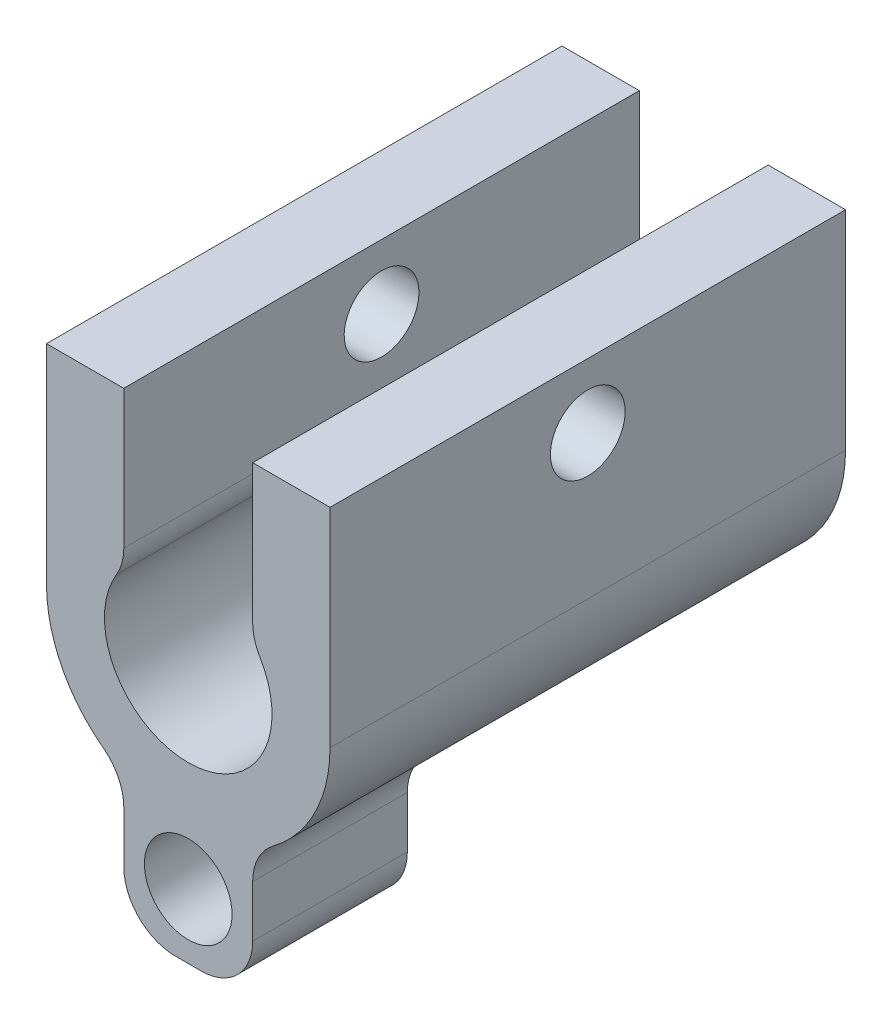
ISO-10303-21;
HEADER;
FILE_DESCRIPTION(('STEP AP214'),'2;1');
FILE_NAME('part.step','',(''),(''),'','','');
FILE_SCHEMA(('AUTOMOTIVE_DESIGN { 1 0 10303 214 1 1 1 1 }'));
ENDSEC;
DATA;
#1=APPLICATION_CONTEXT('core data for automotive mechanical design processes');
#2=APPLICATION_PROTOCOL_DEFINITION('international standard','automotive_design',2000,#1);
#3=PRODUCT_CONTEXT('',#1,'mechanical');
#4=PRODUCT('Part','Part','',(#3));
#5=PRODUCT_RELATED_PRODUCT_CATEGORY('part','',(#4));
#6=PRODUCT_DEFINITION_FORMATION('','',#4);
#7=PRODUCT_DEFINITION_CONTEXT('part definition',#1,'design');
#8=PRODUCT_DEFINITION('design','',#6,#7);
#9=PRODUCT_DEFINITION_SHAPE('','',#8);
#10=(LENGTH_UNIT() NAMED_UNIT(*) SI_UNIT(.MILLI.,.METRE.));
#11=(NAMED_UNIT(*) PLANE_ANGLE_UNIT() SI_UNIT($,.RADIAN.));
#12=(NAMED_UNIT(*) SI_UNIT($,.STERADIAN.) SOLID_ANGLE_UNIT());
#13=UNCERTAINTY_MEASURE_WITH_UNIT(LENGTH_MEASURE(1.E-05),#10,'distance_accuracy_value','');
#14=(GEOMETRIC_REPRESENTATION_CONTEXT(3) GLOBAL_UNCERTAINTY_ASSIGNED_CONTEXT((#13)) GLOBAL_UNIT_ASSIGNED_CONTEXT((#10,
#11,#12)) REPRESENTATION_CONTEXT('',''));
#15=CARTESIAN_POINT('',(0.,0.,0.));
#16=DIRECTION('',(0.,0.,1.));
#17=DIRECTION('',(1.,0.,0.));
#18=AXIS2_PLACEMENT_3D('',#15,#16,#17);
#19=CARTESIAN_POINT('',(0.,0.,20.));
#20=DIRECTION('',(0.,0.,-1.));
#21=DIRECTION('',(-1.,0.,0.));
#22=AXIS2_PLACEMENT_3D('',#19,#20,#21);
#23=CYLINDRICAL_SURFACE('',#22,5.5);
#24=CARTESIAN_POINT('',(0.,0.,0.));
#25=DIRECTION('',(0.,0.,1.));
#26=DIRECTION('',(1.,0.,0.));
#27=AXIS2_PLACEMENT_3D('',#24,#25,#26);
#28=CIRCLE('',#27,5.5);
#29=CARTESIAN_POINT('',(-5.5,0.,0.));
#30=VERTEX_POINT('',#29);
#31=CARTESIAN_POINT('',(-3.3,-4.4,0.));
#32=VERTEX_POINT('',#31);
#33=EDGE_CURVE('E370',#30,#32,#28,.T.);
#34=ORIENTED_EDGE('',*,*,#33,.T.);
#35=DIRECTION('',(0.,0.,-1.));
#36=VECTOR('',#35,1.);
#37=CARTESIAN_POINT('',(-3.3,-4.4,28.655634003353));
#38=LINE('',#37,#36);
#39=CARTESIAN_POINT('',(-3.3,-4.4,14.));
#40=VERTEX_POINT('',#39);
#41=EDGE_CURVE('E349',#40,#32,#38,.T.);
#42=ORIENTED_EDGE('',*,*,#41,.F.);
#43=DIRECTION('',(0.,0.,-1.));
#44=VECTOR('',#43,1.);
#45=CARTESIAN_POINT('',(-3.3,-4.4,20.));
#46=LINE('',#45,#44);
#47=CARTESIAN_POINT('',(-3.3,-4.4,20.));
#48=VERTEX_POINT('',#47);
#49=EDGE_CURVE('E226',#48,#40,#46,.T.);
#50=ORIENTED_EDGE('',*,*,#49,.F.);
#51=CARTESIAN_POINT('',(0.,0.,20.));
#52=DIRECTION('',(0.,0.,1.));
#53=DIRECTION('',(1.,0.,0.));
#54=AXIS2_PLACEMENT_3D('',#51,#52,#53);
#55=CIRCLE('',#54,5.5);
#56=CARTESIAN_POINT('',(-5.5,0.,20.));
#57=VERTEX_POINT('',#56);
#58=EDGE_CURVE('E298',#57,#48,#55,.T.);
#59=ORIENTED_EDGE('',*,*,#58,.F.);
#60=DIRECTION('',(0.,0.,-1.));
#61=VECTOR('',#60,1.);
#62=CARTESIAN_POINT('',(-5.5,0.,20.));
#63=LINE('',#62,#61);
#64=EDGE_CURVE('E299',#57,#30,#63,.T.);
#65=ORIENTED_EDGE('',*,*,#64,.T.);
#66=EDGE_LOOP('',(#34,#42,#50,#59,#65));
#67=FACE_BOUND('',#66,.T.);
#68=ADVANCED_FACE('F41',(#67),#23,.T.);
#69=CARTESIAN_POINT('',(-4.5,-6.,20.));
#70=DIRECTION('',(0.,0.,-1.));
#71=DIRECTION('',(-1.,0.,0.));
#72=AXIS2_PLACEMENT_3D('',#69,#70,#71);
#73=CYLINDRICAL_SURFACE('',#72,2.);
#74=ORIENTED_EDGE('',*,*,#49,.T.);
#75=CARTESIAN_POINT('',(-4.5,-6.,14.));
#76=DIRECTION('',(0.,0.,1.));
#77=DIRECTION('',(1.,0.,0.));
#78=AXIS2_PLACEMENT_3D('',#75,#76,#77);
#79=CIRCLE('',#78,2.);
#80=CARTESIAN_POINT('',(-2.5,-6.,14.));
#81=VERTEX_POINT('',#80);
#82=EDGE_CURVE('E350',#81,#40,#79,.T.);
#83=ORIENTED_EDGE('',*,*,#82,.F.);
#84=DIRECTION('',(0.,0.,-1.));
#85=VECTOR('',#84,1.);
#86=CARTESIAN_POINT('',(-2.5,-6.,20.));
#87=LINE('',#86,#85);
#88=CARTESIAN_POINT('',(-2.5,-6.,20.));
#89=VERTEX_POINT('',#88);
#90=EDGE_CURVE('E222',#89,#81,#87,.T.);
#91=ORIENTED_EDGE('',*,*,#90,.F.);
#92=CARTESIAN_POINT('',(-4.5,-6.,20.));
#93=DIRECTION('',(0.,0.,-1.));
#94=DIRECTION('',(-1.,0.,0.));
#95=AXIS2_PLACEMENT_3D('',#92,#93,#94);
#96=CIRCLE('',#95,2.);
#97=EDGE_CURVE('E374',#48,#89,#96,.T.);
#98=ORIENTED_EDGE('',*,*,#97,.F.);
#99=EDGE_LOOP('',(#74,#83,#91,#98));
#100=FACE_BOUND('',#99,.T.);
#101=ADVANCED_FACE('F455',(#100),#73,.F.);
#102=CARTESIAN_POINT('',(-2.5,-6.,20.));
#103=DIRECTION('',(1.,0.,0.));
#104=DIRECTION('',(0.,0.,-1.));
#105=AXIS2_PLACEMENT_3D('',#102,#103,#104);
#106=PLANE('',#105);
#107=ORIENTED_EDGE('',*,*,#90,.T.);
#108=DIRECTION('',(0.,1.,0.));
#109=VECTOR('',#108,1.);
#110=CARTESIAN_POINT('',(-2.5,-8.,14.));
#111=LINE('',#110,#109);
#112=CARTESIAN_POINT('',(-2.5,-8.,14.));
#113=VERTEX_POINT('',#112);
#114=EDGE_CURVE('E354',#113,#81,#111,.T.);
#115=ORIENTED_EDGE('',*,*,#114,.F.);
#116=DIRECTION('',(0.,0.,-1.));
#117=VECTOR('',#116,1.);
#118=CARTESIAN_POINT('',(-2.5,-8.,20.));
#119=LINE('',#118,#117);
#120=CARTESIAN_POINT('',(-2.5,-8.,20.));
#121=VERTEX_POINT('',#120);
#122=EDGE_CURVE('E218',#121,#113,#119,.T.);
#123=ORIENTED_EDGE('',*,*,#122,.F.);
#124=DIRECTION('',(0.,-1.,0.));
#125=VECTOR('',#124,1.);
#126=CARTESIAN_POINT('',(-2.5,-6.,20.));
#127=LINE('',#126,#125);
#128=EDGE_CURVE('E377',#89,#121,#127,.T.);
#129=ORIENTED_EDGE('',*,*,#128,.F.);
#130=EDGE_LOOP('',(#107,#115,#123,#129));
#131=FACE_BOUND('',#130,.T.);
#132=ADVANCED_FACE('F460',(#131),#106,.F.);
#133=CARTESIAN_POINT('',(-0.5,-8.,20.));
#134=DIRECTION('',(0.,0.,-1.));
#135=DIRECTION('',(-1.,0.,0.));
#136=AXIS2_PLACEMENT_3D('',#133,#134,#135);
#137=CYLINDRICAL_SURFACE('',#136,2.);
#138=ORIENTED_EDGE('',*,*,#122,.T.);
#139=CARTESIAN_POINT('',(-0.5,-8.,14.));
#140=DIRECTION('',(0.,0.,1.));
#141=DIRECTION('',(1.,0.,0.));
#142=AXIS2_PLACEMENT_3D('',#139,#140,#141);
#143=CIRCLE('',#142,2.);
#144=CARTESIAN_POINT('',(-0.5,-10.,14.));
#145=VERTEX_POINT('',#144);
#146=EDGE_CURVE('E357',#145,#113,#143,.F.);
#147=ORIENTED_EDGE('',*,*,#146,.F.);
#148=DIRECTION('',(0.,0.,-1.));
#149=VECTOR('',#148,1.);
#150=CARTESIAN_POINT('',(-0.5,-10.,20.));
#151=LINE('',#150,#149);
#152=CARTESIAN_POINT('',(-0.5,-10.,20.));
#153=VERTEX_POINT('',#152);
#154=EDGE_CURVE('E209',#153,#145,#151,.T.);
#155=ORIENTED_EDGE('',*,*,#154,.F.);
#156=CARTESIAN_POINT('',(-0.5,-8.,20.));
#157=DIRECTION('',(0.,0.,1.));
#158=DIRECTION('',(-1.,0.,0.));
#159=AXIS2_PLACEMENT_3D('',#156,#157,#158);
#160=CIRCLE('',#159,2.);
#161=EDGE_CURVE('E380',#121,#153,#160,.T.);
#162=ORIENTED_EDGE('',*,*,#161,.F.);
#163=EDGE_LOOP('',(#138,#147,#155,#162));
#164=FACE_BOUND('',#163,.T.);
#165=ADVANCED_FACE('F466',(#164),#137,.T.);
#166=CARTESIAN_POINT('',(-0.5,-10.,20.));
#167=DIRECTION('',(0.,1.,0.));
#168=DIRECTION('',(0.,0.,1.));
#169=AXIS2_PLACEMENT_3D('',#166,#167,#168);
#170=PLANE('',#169);
#171=ORIENTED_EDGE('',*,*,#154,.T.);
#172=DIRECTION('',(-1.,0.,0.));
#173=VECTOR('',#172,1.);
#174=CARTESIAN_POINT('',(0.5,-10.,14.));
#175=LINE('',#174,#173);
#176=CARTESIAN_POINT('',(0.500000000000001,-10.,14.));
#177=VERTEX_POINT('',#176);
#178=EDGE_CURVE('E200',#177,#145,#175,.T.);
#179=ORIENTED_EDGE('',*,*,#178,.F.);
#180=DIRECTION('',(0.,0.,-1.));
#181=VECTOR('',#180,1.);
#182=CARTESIAN_POINT('',(0.5,-10.,20.));
#183=LINE('',#182,#181);
#184=CARTESIAN_POINT('',(0.5,-10.,20.));
#185=VERTEX_POINT('',#184);
#186=EDGE_CURVE('E198',#185,#177,#183,.T.);
#187=ORIENTED_EDGE('',*,*,#186,.F.);
#188=DIRECTION('',(1.,0.,0.));
#189=VECTOR('',#188,1.);
#190=CARTESIAN_POINT('',(-0.5,-10.,20.));
#191=LINE('',#190,#189);
#192=EDGE_CURVE('E383',#153,#185,#191,.T.);
#193=ORIENTED_EDGE('',*,*,#192,.F.);
#194=EDGE_LOOP('',(#171,#179,#187,#193));
#195=FACE_BOUND('',#194,.T.);
#196=ADVANCED_FACE('F470',(#195),#170,.F.);
#197=CARTESIAN_POINT('',(0.5,-8.,20.));
#198=DIRECTION('',(0.,0.,-1.));
#199=DIRECTION('',(-1.,0.,0.));
#200=AXIS2_PLACEMENT_3D('',#197,#198,#199);
#201=CYLINDRICAL_SURFACE('',#200,2.);
#202=ORIENTED_EDGE('',*,*,#186,.T.);
#203=CARTESIAN_POINT('',(0.500000000000015,-8.00000000000002,14.));
#204=DIRECTION('',(0.,0.,1.));
#205=DIRECTION('',(1.,0.,0.));
#206=AXIS2_PLACEMENT_3D('',#203,#204,#205);
#207=CIRCLE('',#206,1.99999999999999);
#208=CARTESIAN_POINT('',(2.5,-8.00000000000001,14.));
#209=VERTEX_POINT('',#208);
#210=EDGE_CURVE('E178',#209,#177,#207,.F.);
#211=ORIENTED_EDGE('',*,*,#210,.F.);
#212=DIRECTION('',(0.,0.,-1.));
#213=VECTOR('',#212,1.);
#214=CARTESIAN_POINT('',(2.5,-8.,20.));
#215=LINE('',#214,#213);
#216=CARTESIAN_POINT('',(2.5,-8.,20.));
#217=VERTEX_POINT('',#216);
#218=EDGE_CURVE('E195',#217,#209,#215,.T.);
#219=ORIENTED_EDGE('',*,*,#218,.F.);
#220=CARTESIAN_POINT('',(0.5,-8.,20.));
#221=DIRECTION('',(0.,0.,1.));
#222=DIRECTION('',(1.,0.,0.));
#223=AXIS2_PLACEMENT_3D('',#220,#221,#222);
#224=CIRCLE('',#223,2.);
#225=EDGE_CURVE('E386',#185,#217,#224,.T.);
#226=ORIENTED_EDGE('',*,*,#225,.F.);
#227=EDGE_LOOP('',(#202,#211,#219,#226));
#228=FACE_BOUND('',#227,.T.);
#229=ADVANCED_FACE('F193',(#228),#201,.T.);
#230=CARTESIAN_POINT('',(2.5,-8.,20.));
#231=DIRECTION('',(-1.,0.,0.));
#232=DIRECTION('',(0.,0.,1.));
#233=AXIS2_PLACEMENT_3D('',#230,#231,#232);
#234=PLANE('',#233);
#235=ORIENTED_EDGE('',*,*,#218,.T.);
#236=DIRECTION('',(0.,-1.,0.));
#237=VECTOR('',#236,1.);
#238=CARTESIAN_POINT('',(2.5,-6.,14.));
#239=LINE('',#238,#237);
#240=CARTESIAN_POINT('',(2.5,-6.,14.));
#241=VERTEX_POINT('',#240);
#242=EDGE_CURVE('E175',#241,#209,#239,.T.);
#243=ORIENTED_EDGE('',*,*,#242,.F.);
#244=DIRECTION('',(0.,0.,-1.));
#245=VECTOR('',#244,1.);
#246=CARTESIAN_POINT('',(2.5,-6.,20.));
#247=LINE('',#246,#245);
#248=CARTESIAN_POINT('',(2.5,-6.,20.));
#249=VERTEX_POINT('',#248);
#250=EDGE_CURVE('E205',#249,#241,#247,.T.);
#251=ORIENTED_EDGE('',*,*,#250,.F.);
#252=DIRECTION('',(0.,1.,0.));
#253=VECTOR('',#252,1.);
#254=CARTESIAN_POINT('',(2.5,-8.,20.));
#255=LINE('',#254,#253);
#256=EDGE_CURVE('E203',#217,#249,#255,.T.);
#257=ORIENTED_EDGE('',*,*,#256,.F.);
#258=EDGE_LOOP('',(#235,#243,#251,#257));
#259=FACE_BOUND('',#258,.T.);
#260=ADVANCED_FACE('F202',(#259),#234,.F.);
#261=CARTESIAN_POINT('',(4.5,-6.,20.));
#262=DIRECTION('',(0.,0.,-1.));
#263=DIRECTION('',(-1.,0.,0.));
#264=AXIS2_PLACEMENT_3D('',#261,#262,#263);
#265=CYLINDRICAL_SURFACE('',#264,2.);
#266=ORIENTED_EDGE('',*,*,#250,.T.);
#267=CARTESIAN_POINT('',(4.5,-6.,14.));
#268=DIRECTION('',(0.,0.,1.));
#269=DIRECTION('',(1.,0.,0.));
#270=AXIS2_PLACEMENT_3D('',#267,#268,#269);
#271=CIRCLE('',#270,2.);
#272=CARTESIAN_POINT('',(3.3,-4.4,14.));
#273=VERTEX_POINT('',#272);
#274=EDGE_CURVE('E182',#273,#241,#271,.T.);
#275=ORIENTED_EDGE('',*,*,#274,.F.);
#276=DIRECTION('',(0.,0.,-1.));
#277=VECTOR('',#276,1.);
#278=CARTESIAN_POINT('',(3.3,-4.4,20.));
#279=LINE('',#278,#277);
#280=CARTESIAN_POINT('',(3.3,-4.4,20.));
#281=VERTEX_POINT('',#280);
#282=EDGE_CURVE('E211',#281,#273,#279,.T.);
#283=ORIENTED_EDGE('',*,*,#282,.F.);
#284=CARTESIAN_POINT('',(4.5,-6.,20.));
#285=DIRECTION('',(0.,0.,-1.));
#286=DIRECTION('',(1.,0.,0.));
#287=AXIS2_PLACEMENT_3D('',#284,#285,#286);
#288=CIRCLE('',#287,2.);
#289=EDGE_CURVE('E335',#249,#281,#288,.T.);
#290=ORIENTED_EDGE('',*,*,#289,.F.);
#291=EDGE_LOOP('',(#266,#275,#283,#290));
#292=FACE_BOUND('',#291,.T.);
#293=ADVANCED_FACE('F334',(#292),#265,.F.);
#294=CARTESIAN_POINT('',(0.,0.,20.));
#295=DIRECTION('',(0.,0.,-1.));
#296=DIRECTION('',(-1.,0.,0.));
#297=AXIS2_PLACEMENT_3D('',#294,#295,#296);
#298=CYLINDRICAL_SURFACE('',#297,5.5);
#299=CARTESIAN_POINT('',(0.,0.,0.));
#300=DIRECTION('',(0.,0.,1.));
#301=DIRECTION('',(1.,0.,0.));
#302=AXIS2_PLACEMENT_3D('',#299,#300,#301);
#303=CIRCLE('',#302,5.5);
#304=CARTESIAN_POINT('',(3.3,-4.4,0.));
#305=VERTEX_POINT('',#304);
#306=CARTESIAN_POINT('',(5.5,0.,0.));
#307=VERTEX_POINT('',#306);
#308=EDGE_CURVE('E413',#305,#307,#303,.T.);
#309=ORIENTED_EDGE('',*,*,#308,.T.);
#310=DIRECTION('',(0.,0.,-1.));
#311=VECTOR('',#310,1.);
#312=CARTESIAN_POINT('',(5.5,0.,20.));
#313=LINE('',#312,#311);
#314=CARTESIAN_POINT('',(5.5,0.,20.));
#315=VERTEX_POINT('',#314);
#316=EDGE_CURVE('E318',#315,#307,#313,.T.);
#317=ORIENTED_EDGE('',*,*,#316,.F.);
#318=CARTESIAN_POINT('',(0.,0.,20.));
#319=DIRECTION('',(0.,0.,1.));
#320=DIRECTION('',(1.,0.,0.));
#321=AXIS2_PLACEMENT_3D('',#318,#319,#320);
#322=CIRCLE('',#321,5.5);
#323=EDGE_CURVE('E331',#281,#315,#322,.T.);
#324=ORIENTED_EDGE('',*,*,#323,.F.);
#325=ORIENTED_EDGE('',*,*,#282,.T.);
#326=DIRECTION('',(0.,0.,-1.));
#327=VECTOR('',#326,1.);
#328=CARTESIAN_POINT('',(3.3,-4.4,28.655634003353));
#329=LINE('',#328,#327);
#330=EDGE_CURVE('E328',#273,#305,#329,.T.);
#331=ORIENTED_EDGE('',*,*,#330,.T.);
#332=EDGE_LOOP('',(#309,#317,#324,#325,#331));
#333=FACE_BOUND('',#332,.T.);
#334=ADVANCED_FACE('F327',(#333),#298,.T.);
#335=CARTESIAN_POINT('',(5.5,0.,20.));
#336=DIRECTION('',(-1.,0.,0.));
#337=DIRECTION('',(0.,0.,1.));
#338=AXIS2_PLACEMENT_3D('',#335,#336,#337);
#339=PLANE('',#338);
#340=CARTESIAN_POINT('',(5.5,5.57665596572952,10.));
#341=DIRECTION('',(1.,0.,0.));
#342=DIRECTION('',(0.,0.,-1.));
#343=AXIS2_PLACEMENT_3D('',#340,#341,#342);
#344=CIRCLE('',#343,1.45);
#345=CARTESIAN_POINT('',(5.5,5.57665596572952,8.55));
#346=VERTEX_POINT('',#345);
#347=EDGE_CURVE('E337',#346,#346,#344,.T.);
#348=ORIENTED_EDGE('',*,*,#347,.F.);
#349=EDGE_LOOP('',(#348));
#350=FACE_BOUND('',#349,.T.);
#351=DIRECTION('',(0.,1.,0.));
#352=VECTOR('',#351,1.);
#353=CARTESIAN_POINT('',(5.5,0.,0.));
#354=LINE('',#353,#352);
#355=CARTESIAN_POINT('',(5.5,8.07665596572952,0.));
#356=VERTEX_POINT('',#355);
#357=EDGE_CURVE('E286',#307,#356,#354,.T.);
#358=ORIENTED_EDGE('',*,*,#357,.T.);
#359=DIRECTION('',(0.,0.,-1.));
#360=VECTOR('',#359,1.);
#361=CARTESIAN_POINT('',(5.5,8.07665596572952,20.));
#362=LINE('',#361,#360);
#363=CARTESIAN_POINT('',(5.5,8.07665596572952,20.));
#364=VERTEX_POINT('',#363);
#365=EDGE_CURVE('E314',#364,#356,#362,.T.);
#366=ORIENTED_EDGE('',*,*,#365,.F.);
#367=DIRECTION('',(0.,1.,0.));
#368=VECTOR('',#367,1.);
#369=CARTESIAN_POINT('',(5.5,0.,20.));
#370=LINE('',#369,#368);
#371=EDGE_CURVE('E395',#315,#364,#370,.T.);
#372=ORIENTED_EDGE('',*,*,#371,.F.);
#373=ORIENTED_EDGE('',*,*,#316,.T.);
#374=EDGE_LOOP('',(#358,#366,#372,#373));
#375=FACE_BOUND('',#374,.T.);
#376=ADVANCED_FACE('F419',(#350,#375),#339,.F.);
#377=CARTESIAN_POINT('',(5.5,8.07665596572952,20.));
#378=DIRECTION('',(0.,-1.,0.));
#379=DIRECTION('',(0.,0.,-1.));
#380=AXIS2_PLACEMENT_3D('',#377,#378,#379);
#381=PLANE('',#380);
#382=DIRECTION('',(-1.,0.,0.));
#383=VECTOR('',#382,1.);
#384=CARTESIAN_POINT('',(5.5,8.07665596572952,0.));
#385=LINE('',#384,#383);
#386=CARTESIAN_POINT('',(2.5,8.07665596572952,0.));
#387=VERTEX_POINT('',#386);
#388=EDGE_CURVE('E280',#356,#387,#385,.T.);
#389=ORIENTED_EDGE('',*,*,#388,.T.);
#390=DIRECTION('',(0.,0.,-1.));
#391=VECTOR('',#390,1.);
#392=CARTESIAN_POINT('',(2.5,8.07665596572952,20.));
#393=LINE('',#392,#391);
#394=CARTESIAN_POINT('',(2.5,8.07665596572952,20.));
#395=VERTEX_POINT('',#394);
#396=EDGE_CURVE('E278',#395,#387,#393,.T.);
#397=ORIENTED_EDGE('',*,*,#396,.F.);
#398=DIRECTION('',(-1.,0.,0.));
#399=VECTOR('',#398,1.);
#400=CARTESIAN_POINT('',(5.5,8.07665596572952,20.));
#401=LINE('',#400,#399);
#402=EDGE_CURVE('E398',#364,#395,#401,.T.);
#403=ORIENTED_EDGE('',*,*,#402,.F.);
#404=ORIENTED_EDGE('',*,*,#365,.T.);
#405=EDGE_LOOP('',(#389,#397,#403,#404));
#406=FACE_BOUND('',#405,.T.);
#407=ADVANCED_FACE('F423',(#406),#381,.F.);
#408=CARTESIAN_POINT('',(2.5,8.07665596572952,20.));
#409=DIRECTION('',(1.,0.,0.));
#410=DIRECTION('',(0.,1.,0.));
#411=AXIS2_PLACEMENT_3D('',#408,#409,#410);
#412=PLANE('',#411);
#413=CARTESIAN_POINT('',(2.5,5.57665596572952,10.));
#414=DIRECTION('',(1.,0.,0.));
#415=DIRECTION('',(0.,1.,0.));
#416=AXIS2_PLACEMENT_3D('',#413,#414,#415);
#417=CIRCLE('',#416,1.45);
#418=CARTESIAN_POINT('',(2.5,7.02665596572952,10.));
#419=VERTEX_POINT('',#418);
#420=EDGE_CURVE('E235',#419,#419,#417,.T.);
#421=ORIENTED_EDGE('',*,*,#420,.T.);
#422=EDGE_LOOP('',(#421));
#423=FACE_BOUND('',#422,.T.);
#424=DIRECTION('',(0.,-1.,0.));
#425=VECTOR('',#424,1.);
#426=CARTESIAN_POINT('',(2.5,8.07665596572952,0.));
#427=LINE('',#426,#425);
#428=CARTESIAN_POINT('',(2.5,2.70416345659799,0.));
#429=VERTEX_POINT('',#428);
#430=EDGE_CURVE('E273',#387,#429,#427,.T.);
#431=ORIENTED_EDGE('',*,*,#430,.T.);
#432=DIRECTION('',(0.,0.,-1.));
#433=VECTOR('',#432,1.);
#434=CARTESIAN_POINT('',(2.5,2.70416345659799,20.));
#435=LINE('',#434,#433);
#436=CARTESIAN_POINT('',(2.5,2.70416345659799,20.));
#437=VERTEX_POINT('',#436);
#438=EDGE_CURVE('E65',#429,#437,#435,.F.);
#439=ORIENTED_EDGE('',*,*,#438,.T.);
#440=DIRECTION('',(0.,-1.,0.));
#441=VECTOR('',#440,1.);
#442=CARTESIAN_POINT('',(2.5,8.07665596572952,20.));
#443=LINE('',#442,#441);
#444=EDGE_CURVE('E257',#395,#437,#443,.T.);
#445=ORIENTED_EDGE('',*,*,#444,.F.);
#446=ORIENTED_EDGE('',*,*,#396,.T.);
#447=EDGE_LOOP('',(#431,#439,#445,#446));
#448=FACE_BOUND('',#447,.T.);
#449=ADVANCED_FACE('F276',(#423,#448),#412,.F.);
#450=CARTESIAN_POINT('',(0.,0.,20.));
#451=DIRECTION('',(0.,0.,-1.));
#452=DIRECTION('',(-1.,0.,0.));
#453=AXIS2_PLACEMENT_3D('',#450,#451,#452);
#454=CYLINDRICAL_SURFACE('',#453,3.25);
#455=CARTESIAN_POINT('',(0.,0.,20.));
#456=DIRECTION('',(0.,0.,-1.));
#457=DIRECTION('',(1.,0.,0.));
#458=AXIS2_PLACEMENT_3D('',#455,#456,#457);
#459=CIRCLE('',#458,3.25);
#460=CARTESIAN_POINT('',(2.78571428571429,1.67400594932257,20.));
#461=VERTEX_POINT('',#460);
#462=CARTESIAN_POINT('',(-2.78571428571429,1.67400594932257,20.));
#463=VERTEX_POINT('',#462);
#464=EDGE_CURVE('E256',#461,#463,#459,.T.);
#465=ORIENTED_EDGE('',*,*,#464,.F.);
#466=DIRECTION('',(0.,0.,-1.));
#467=VECTOR('',#466,1.);
#468=CARTESIAN_POINT('',(2.78571428571429,1.67400594932257,20.));
#469=LINE('',#468,#467);
#470=CARTESIAN_POINT('',(2.78571428571429,1.67400594932257,0.));
#471=VERTEX_POINT('',#470);
#472=EDGE_CURVE('E239',#461,#471,#469,.T.);
#473=ORIENTED_EDGE('',*,*,#472,.T.);
#474=CARTESIAN_POINT('',(0.,0.,0.));
#475=DIRECTION('',(0.,0.,-1.));
#476=DIRECTION('',(1.,0.,0.));
#477=AXIS2_PLACEMENT_3D('',#474,#475,#476);
#478=CIRCLE('',#477,3.25);
#479=CARTESIAN_POINT('',(-2.78571428571429,1.67400594932257,0.));
#480=VERTEX_POINT('',#479);
#481=EDGE_CURVE('E274',#471,#480,#478,.T.);
#482=ORIENTED_EDGE('',*,*,#481,.T.);
#483=DIRECTION('',(0.,0.,-1.));
#484=VECTOR('',#483,1.);
#485=CARTESIAN_POINT('',(-2.78571428571429,1.67400594932257,20.));
#486=LINE('',#485,#484);
#487=EDGE_CURVE('E230',#480,#463,#486,.F.);
#488=ORIENTED_EDGE('',*,*,#487,.T.);
#489=EDGE_LOOP('',(#465,#473,#482,#488));
#490=FACE_BOUND('',#489,.T.);
#491=ADVANCED_FACE('F261',(#490),#454,.F.);
#492=CARTESIAN_POINT('',(-2.5,8.07665596572952,20.));
#493=DIRECTION('',(-1.,0.,0.));
#494=DIRECTION('',(0.,-1.,0.));
#495=AXIS2_PLACEMENT_3D('',#492,#493,#494);
#496=PLANE('',#495);
#497=CARTESIAN_POINT('',(-2.5,5.57665596572952,10.));
#498=DIRECTION('',(-1.,0.,0.));
#499=DIRECTION('',(0.,-1.,0.));
#500=AXIS2_PLACEMENT_3D('',#497,#498,#499);
#501=CIRCLE('',#500,1.45);
#502=CARTESIAN_POINT('',(-2.5,4.12665596572952,10.));
#503=VERTEX_POINT('',#502);
#504=EDGE_CURVE('E231',#503,#503,#501,.T.);
#505=ORIENTED_EDGE('',*,*,#504,.T.);
#506=EDGE_LOOP('',(#505));
#507=FACE_BOUND('',#506,.T.);
#508=DIRECTION('',(0.,1.,0.));
#509=VECTOR('',#508,1.);
#510=CARTESIAN_POINT('',(-2.5,8.07665596572952,20.));
#511=LINE('',#510,#509);
#512=CARTESIAN_POINT('',(-2.5,2.70416345659799,20.));
#513=VERTEX_POINT('',#512);
#514=CARTESIAN_POINT('',(-2.5,8.07665596572952,20.));
#515=VERTEX_POINT('',#514);
#516=EDGE_CURVE('E266',#513,#515,#511,.T.);
#517=ORIENTED_EDGE('',*,*,#516,.F.);
#518=DIRECTION('',(0.,0.,-1.));
#519=VECTOR('',#518,1.);
#520=CARTESIAN_POINT('',(-2.5,2.70416345659799,20.));
#521=LINE('',#520,#519);
#522=CARTESIAN_POINT('',(-2.5,2.70416345659799,0.));
#523=VERTEX_POINT('',#522);
#524=EDGE_CURVE('E12',#513,#523,#521,.T.);
#525=ORIENTED_EDGE('',*,*,#524,.T.);
#526=DIRECTION('',(0.,1.,0.));
#527=VECTOR('',#526,1.);
#528=CARTESIAN_POINT('',(-2.5,8.07665596572952,0.));
#529=LINE('',#528,#527);
#530=CARTESIAN_POINT('',(-2.5,8.07665596572952,0.));
#531=VERTEX_POINT('',#530);
#532=EDGE_CURVE('E284',#523,#531,#529,.T.);
#533=ORIENTED_EDGE('',*,*,#532,.T.);
#534=DIRECTION('',(0.,0.,-1.));
#535=VECTOR('',#534,1.);
#536=CARTESIAN_POINT('',(-2.5,8.07665596572952,20.));
#537=LINE('',#536,#535);
#538=EDGE_CURVE('E308',#515,#531,#537,.T.);
#539=ORIENTED_EDGE('',*,*,#538,.F.);
#540=EDGE_LOOP('',(#517,#525,#533,#539));
#541=FACE_BOUND('',#540,.T.);
#542=ADVANCED_FACE('F446',(#507,#541),#496,.F.);
#543=CARTESIAN_POINT('',(-5.5,8.07665596572952,20.));
#544=DIRECTION('',(0.,-1.,0.));
#545=DIRECTION('',(0.,0.,-1.));
#546=AXIS2_PLACEMENT_3D('',#543,#544,#545);
#547=PLANE('',#546);
#548=DIRECTION('',(-1.,0.,0.));
#549=VECTOR('',#548,1.);
#550=CARTESIAN_POINT('',(-5.5,8.07665596572952,0.));
#551=LINE('',#550,#549);
#552=CARTESIAN_POINT('',(-5.5,8.07665596572952,0.));
#553=VERTEX_POINT('',#552);
#554=EDGE_CURVE('E292',#531,#553,#551,.T.);
#555=ORIENTED_EDGE('',*,*,#554,.T.);
#556=DIRECTION('',(0.,0.,-1.));
#557=VECTOR('',#556,1.);
#558=CARTESIAN_POINT('',(-5.5,8.07665596572952,20.));
#559=LINE('',#558,#557);
#560=CARTESIAN_POINT('',(-5.5,8.07665596572952,20.));
#561=VERTEX_POINT('',#560);
#562=EDGE_CURVE('E303',#561,#553,#559,.T.);
#563=ORIENTED_EDGE('',*,*,#562,.F.);
#564=DIRECTION('',(-1.,0.,0.));
#565=VECTOR('',#564,1.);
#566=CARTESIAN_POINT('',(-5.5,8.07665596572952,20.));
#567=LINE('',#566,#565);
#568=EDGE_CURVE('E405',#515,#561,#567,.T.);
#569=ORIENTED_EDGE('',*,*,#568,.F.);
#570=ORIENTED_EDGE('',*,*,#538,.T.);
#571=EDGE_LOOP('',(#555,#563,#569,#570));
#572=FACE_BOUND('',#571,.T.);
#573=ADVANCED_FACE('F442',(#572),#547,.F.);
#574=CARTESIAN_POINT('',(-5.5,0.,20.));
#575=DIRECTION('',(1.,0.,0.));
#576=DIRECTION('',(0.,0.,-1.));
#577=AXIS2_PLACEMENT_3D('',#574,#575,#576);
#578=PLANE('',#577);
#579=CARTESIAN_POINT('',(-5.5,5.57665596572952,10.));
#580=DIRECTION('',(1.,0.,0.));
#581=DIRECTION('',(0.,0.,-1.));
#582=AXIS2_PLACEMENT_3D('',#579,#580,#581);
#583=CIRCLE('',#582,1.45);
#584=CARTESIAN_POINT('',(-5.5,5.57665596572952,8.55));
#585=VERTEX_POINT('',#584);
#586=EDGE_CURVE('E236',#585,#585,#583,.T.);
#587=ORIENTED_EDGE('',*,*,#586,.T.);
#588=EDGE_LOOP('',(#587));
#589=FACE_BOUND('',#588,.T.);
#590=DIRECTION('',(0.,-1.,0.));
#591=VECTOR('',#590,1.);
#592=CARTESIAN_POINT('',(-5.5,0.,0.));
#593=LINE('',#592,#591);
#594=EDGE_CURVE('E295',#553,#30,#593,.T.);
#595=ORIENTED_EDGE('',*,*,#594,.T.);
#596=ORIENTED_EDGE('',*,*,#64,.F.);
#597=DIRECTION('',(0.,-1.,0.));
#598=VECTOR('',#597,1.);
#599=CARTESIAN_POINT('',(-5.5,0.,20.));
#600=LINE('',#599,#598);
#601=EDGE_CURVE('E304',#561,#57,#600,.T.);
#602=ORIENTED_EDGE('',*,*,#601,.F.);
#603=ORIENTED_EDGE('',*,*,#562,.T.);
#604=EDGE_LOOP('',(#595,#596,#602,#603));
#605=FACE_BOUND('',#604,.T.);
#606=ADVANCED_FACE('F437',(#589,#605),#578,.F.);
#607=CARTESIAN_POINT('',(0.,0.,20.));
#608=DIRECTION('',(0.,0.,1.));
#609=DIRECTION('',(1.,0.,0.));
#610=AXIS2_PLACEMENT_3D('',#607,#608,#609);
#611=PLANE('',#610);
#612=CARTESIAN_POINT('',(0.,-7.5,20.));
#613=DIRECTION('',(0.,0.,1.));
#614=DIRECTION('',(1.,0.,0.));
#615=AXIS2_PLACEMENT_3D('',#612,#613,#614);
#616=CIRCLE('',#615,1.7);
#617=CARTESIAN_POINT('',(1.7,-7.5,20.));
#618=VERTEX_POINT('',#617);
#619=EDGE_CURVE('E524',#618,#618,#616,.T.);
#620=ORIENTED_EDGE('',*,*,#619,.F.);
#621=EDGE_LOOP('',(#620));
#622=FACE_BOUND('',#621,.T.);
#623=ORIENTED_EDGE('',*,*,#444,.T.);
#624=CARTESIAN_POINT('',(4.5,2.70416345659799,20.));
#625=DIRECTION('',(0.,0.,1.));
#626=DIRECTION('',(1.,0.,0.));
#627=AXIS2_PLACEMENT_3D('',#624,#625,#626);
#628=CIRCLE('',#627,2.);
#629=EDGE_CURVE('E50',#437,#461,#628,.T.);
#630=ORIENTED_EDGE('',*,*,#629,.T.);
#631=ORIENTED_EDGE('',*,*,#464,.T.);
#632=CARTESIAN_POINT('',(-4.5,2.70416345659799,20.));
#633=DIRECTION('',(0.,0.,1.));
#634=DIRECTION('',(1.,0.,0.));
#635=AXIS2_PLACEMENT_3D('',#632,#633,#634);
#636=CIRCLE('',#635,2.);
#637=EDGE_CURVE('E57',#463,#513,#636,.T.);
#638=ORIENTED_EDGE('',*,*,#637,.T.);
#639=ORIENTED_EDGE('',*,*,#516,.T.);
#640=ORIENTED_EDGE('',*,*,#568,.T.);
#641=ORIENTED_EDGE('',*,*,#601,.T.);
#642=ORIENTED_EDGE('',*,*,#58,.T.);
#643=ORIENTED_EDGE('',*,*,#97,.T.);
#644=ORIENTED_EDGE('',*,*,#128,.T.);
#645=ORIENTED_EDGE('',*,*,#161,.T.);
#646=ORIENTED_EDGE('',*,*,#192,.T.);
#647=ORIENTED_EDGE('',*,*,#225,.T.);
#648=ORIENTED_EDGE('',*,*,#256,.T.);
#649=ORIENTED_EDGE('',*,*,#289,.T.);
#650=ORIENTED_EDGE('',*,*,#323,.T.);
#651=ORIENTED_EDGE('',*,*,#371,.T.);
#652=ORIENTED_EDGE('',*,*,#402,.T.);
#653=EDGE_LOOP('',(#623,#630,#631,#638,#639,#640,#641,#642,#643,#644,#645,#646,#647,#648,#649,
#650,#651,#652));
#654=FACE_BOUND('',#653,.T.);
#655=ADVANCED_FACE('F255',(#622,#654),#611,.T.);
#656=CARTESIAN_POINT('',(0.,0.,0.));
#657=DIRECTION('',(0.,0.,1.));
#658=DIRECTION('',(1.,0.,0.));
#659=AXIS2_PLACEMENT_3D('',#656,#657,#658);
#660=PLANE('',#659);
#661=ORIENTED_EDGE('',*,*,#481,.F.);
#662=CARTESIAN_POINT('',(4.5,2.70416345659799,0.));
#663=DIRECTION('',(0.,0.,1.));
#664=DIRECTION('',(1.,0.,0.));
#665=AXIS2_PLACEMENT_3D('',#662,#663,#664);
#666=CIRCLE('',#665,2.);
#667=EDGE_CURVE('E246',#471,#429,#666,.F.);
#668=ORIENTED_EDGE('',*,*,#667,.T.);
#669=ORIENTED_EDGE('',*,*,#430,.F.);
#670=ORIENTED_EDGE('',*,*,#388,.F.);
#671=ORIENTED_EDGE('',*,*,#357,.F.);
#672=ORIENTED_EDGE('',*,*,#308,.F.);
#673=DIRECTION('',(1.,0.,0.));
#674=VECTOR('',#673,1.);
#675=CARTESIAN_POINT('',(3.3,-4.4,0.));
#676=LINE('',#675,#674);
#677=EDGE_CURVE('E188',#32,#305,#676,.T.);
#678=ORIENTED_EDGE('',*,*,#677,.F.);
#679=ORIENTED_EDGE('',*,*,#33,.F.);
#680=ORIENTED_EDGE('',*,*,#594,.F.);
#681=ORIENTED_EDGE('',*,*,#554,.F.);
#682=ORIENTED_EDGE('',*,*,#532,.F.);
#683=CARTESIAN_POINT('',(-4.5,2.70416345659799,0.));
#684=DIRECTION('',(0.,0.,1.));
#685=DIRECTION('',(1.,0.,0.));
#686=AXIS2_PLACEMENT_3D('',#683,#684,#685);
#687=CIRCLE('',#686,2.);
#688=EDGE_CURVE('E243',#523,#480,#687,.F.);
#689=ORIENTED_EDGE('',*,*,#688,.T.);
#690=EDGE_LOOP('',(#661,#668,#669,#670,#671,#672,#678,#679,#680,#681,#682,#689));
#691=FACE_BOUND('',#690,.T.);
#692=ADVANCED_FACE('F271',(#691),#660,.F.);
#693=CARTESIAN_POINT('',(5.5,5.57665596572952,10.));
#694=DIRECTION('',(1.,0.,0.));
#695=DIRECTION('',(0.,0.,-1.));
#696=AXIS2_PLACEMENT_3D('',#693,#694,#695);
#697=CYLINDRICAL_SURFACE('',#696,1.45);
#698=ORIENTED_EDGE('',*,*,#586,.F.);
#699=EDGE_LOOP('',(#698));
#700=FACE_BOUND('',#699,.T.);
#701=ORIENTED_EDGE('',*,*,#504,.F.);
#702=EDGE_LOOP('',(#701));
#703=FACE_BOUND('',#702,.T.);
#704=ADVANCED_FACE('F503',(#700,#703),#697,.F.);
#705=ORIENTED_EDGE('',*,*,#347,.T.);
#706=EDGE_LOOP('',(#705));
#707=FACE_BOUND('',#706,.T.);
#708=ORIENTED_EDGE('',*,*,#420,.F.);
#709=EDGE_LOOP('',(#708));
#710=FACE_BOUND('',#709,.T.);
#711=ADVANCED_FACE('F507',(#707,#710),#697,.F.);
#712=CARTESIAN_POINT('',(0.,0.,14.));
#713=DIRECTION('',(0.,0.,1.));
#714=DIRECTION('',(1.,0.,0.));
#715=AXIS2_PLACEMENT_3D('',#712,#713,#714);
#716=PLANE('',#715);
#717=CARTESIAN_POINT('',(0.,-7.5,14.));
#718=DIRECTION('',(0.,0.,1.));
#719=DIRECTION('',(1.,0.,0.));
#720=AXIS2_PLACEMENT_3D('',#717,#718,#719);
#721=CIRCLE('',#720,1.7);
#722=CARTESIAN_POINT('',(1.7,-7.5,14.));
#723=VERTEX_POINT('',#722);
#724=EDGE_CURVE('E429',#723,#723,#721,.T.);
#725=ORIENTED_EDGE('',*,*,#724,.T.);
#726=EDGE_LOOP('',(#725));
#727=FACE_BOUND('',#726,.T.);
#728=ORIENTED_EDGE('',*,*,#274,.T.);
#729=ORIENTED_EDGE('',*,*,#242,.T.);
#730=ORIENTED_EDGE('',*,*,#210,.T.);
#731=ORIENTED_EDGE('',*,*,#178,.T.);
#732=ORIENTED_EDGE('',*,*,#146,.T.);
#733=ORIENTED_EDGE('',*,*,#114,.T.);
#734=ORIENTED_EDGE('',*,*,#82,.T.);
#735=DIRECTION('',(1.,0.,0.));
#736=VECTOR('',#735,1.);
#737=CARTESIAN_POINT('',(3.3,-4.4,14.));
#738=LINE('',#737,#736);
#739=EDGE_CURVE('E343',#40,#273,#738,.T.);
#740=ORIENTED_EDGE('',*,*,#739,.T.);
#741=EDGE_LOOP('',(#728,#729,#730,#731,#732,#733,#734,#740));
#742=FACE_BOUND('',#741,.T.);
#743=ADVANCED_FACE('F177',(#727,#742),#716,.F.);
#744=CARTESIAN_POINT('',(3.3,-4.4,28.655634003353));
#745=DIRECTION('',(0.,1.,0.));
#746=DIRECTION('',(-1.,0.,0.));
#747=AXIS2_PLACEMENT_3D('',#744,#745,#746);
#748=PLANE('',#747);
#749=ORIENTED_EDGE('',*,*,#41,.T.);
#750=ORIENTED_EDGE('',*,*,#677,.T.);
#751=ORIENTED_EDGE('',*,*,#330,.F.);
#752=ORIENTED_EDGE('',*,*,#739,.F.);
#753=EDGE_LOOP('',(#749,#750,#751,#752));
#754=FACE_BOUND('',#753,.T.);
#755=ADVANCED_FACE('F513',(#754),#748,.F.);
#756=CARTESIAN_POINT('',(0.,-7.5,20.));
#757=DIRECTION('',(0.,0.,1.));
#758=DIRECTION('',(1.,0.,0.));
#759=AXIS2_PLACEMENT_3D('',#756,#757,#758);
#760=CYLINDRICAL_SURFACE('',#759,1.7);
#761=ORIENTED_EDGE('',*,*,#619,.T.);
#762=EDGE_LOOP('',(#761));
#763=FACE_BOUND('',#762,.T.);
#764=ORIENTED_EDGE('',*,*,#724,.F.);
#765=EDGE_LOOP('',(#764));
#766=FACE_BOUND('',#765,.T.);
#767=ADVANCED_FACE('F453',(#763,#766),#760,.F.);
#768=CARTESIAN_POINT('',(4.5,2.70416345659799,20.));
#769=DIRECTION('',(0.,0.,-1.));
#770=DIRECTION('',(-1.,0.,0.));
#771=AXIS2_PLACEMENT_3D('',#768,#769,#770);
#772=CYLINDRICAL_SURFACE('',#771,2.);
#773=ORIENTED_EDGE('',*,*,#629,.F.);
#774=ORIENTED_EDGE('',*,*,#438,.F.);
#775=ORIENTED_EDGE('',*,*,#667,.F.);
#776=ORIENTED_EDGE('',*,*,#472,.F.);
#777=EDGE_LOOP('',(#773,#774,#775,#776));
#778=FACE_BOUND('',#777,.T.);
#779=ADVANCED_FACE('F268',(#778),#772,.T.);
#780=CARTESIAN_POINT('',(-4.5,2.70416345659799,20.));
#781=DIRECTION('',(0.,0.,-1.));
#782=DIRECTION('',(-1.,0.,0.));
#783=AXIS2_PLACEMENT_3D('',#780,#781,#782);
#784=CYLINDRICAL_SURFACE('',#783,2.);
#785=ORIENTED_EDGE('',*,*,#637,.F.);
#786=ORIENTED_EDGE('',*,*,#487,.F.);
#787=ORIENTED_EDGE('',*,*,#688,.F.);
#788=ORIENTED_EDGE('',*,*,#524,.F.);
#789=EDGE_LOOP('',(#785,#786,#787,#788));
#790=FACE_BOUND('',#789,.T.);
#791=ADVANCED_FACE('F43',(#790),#784,.T.);
#792=CLOSED_SHELL('',(#68,#101,#132,#165,#196,#229,#260,#293,#334,#376,#407,#449,#491,#542,#573,
#606,#655,#692,#704,#711,#743,#755,#767,#779,#791));
#793=MANIFOLD_SOLID_BREP('B2',#792);
#794=ADVANCED_BREP_SHAPE_REPRESENTATION('',(#18,#793),#14);
#795=SHAPE_DEFINITION_REPRESENTATION(#9,#794);
ENDSEC;
END-ISO-10303-21;
